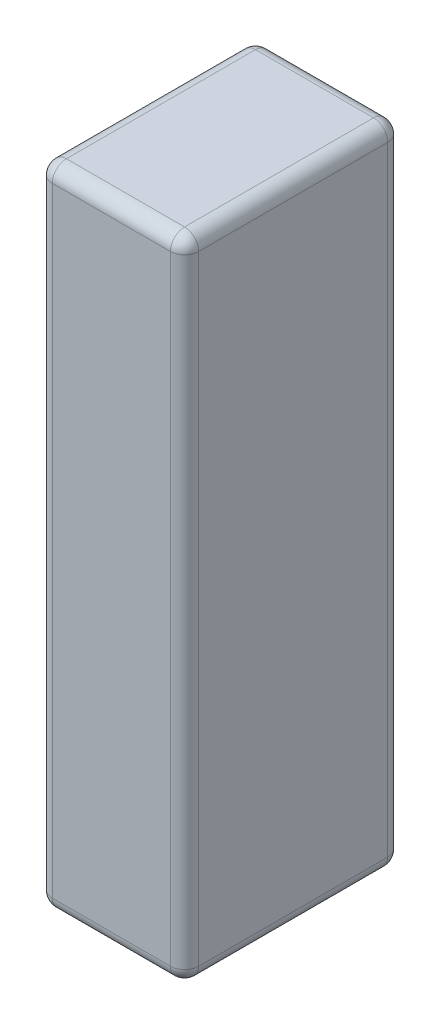
ISO-10303-21;
HEADER;
FILE_DESCRIPTION(('STEP AP214'),'2;1');
FILE_NAME('part.step','',(''),(''),'','','');
FILE_SCHEMA(('AUTOMOTIVE_DESIGN { 1 0 10303 214 1 1 1 1 }'));
ENDSEC;
DATA;
#1=APPLICATION_CONTEXT('core data for automotive mechanical design processes');
#2=APPLICATION_PROTOCOL_DEFINITION('international standard','automotive_design',2000,#1);
#3=PRODUCT_CONTEXT('',#1,'mechanical');
#4=PRODUCT('Part','Part','',(#3));
#5=PRODUCT_RELATED_PRODUCT_CATEGORY('part','',(#4));
#6=PRODUCT_DEFINITION_FORMATION('','',#4);
#7=PRODUCT_DEFINITION_CONTEXT('part definition',#1,'design');
#8=PRODUCT_DEFINITION('design','',#6,#7);
#9=PRODUCT_DEFINITION_SHAPE('','',#8);
#10=(LENGTH_UNIT() NAMED_UNIT(*) SI_UNIT(.MILLI.,.METRE.));
#11=(NAMED_UNIT(*) PLANE_ANGLE_UNIT() SI_UNIT($,.RADIAN.));
#12=(NAMED_UNIT(*) SI_UNIT($,.STERADIAN.) SOLID_ANGLE_UNIT());
#13=UNCERTAINTY_MEASURE_WITH_UNIT(LENGTH_MEASURE(1.E-05),#10,'distance_accuracy_value','');
#14=(GEOMETRIC_REPRESENTATION_CONTEXT(3) GLOBAL_UNCERTAINTY_ASSIGNED_CONTEXT((#13)) GLOBAL_UNIT_ASSIGNED_CONTEXT((#10,
#11,#12)) REPRESENTATION_CONTEXT('',''));
#15=CARTESIAN_POINT('',(0.,0.,0.));
#16=DIRECTION('',(0.,0.,1.));
#17=DIRECTION('',(1.,0.,0.));
#18=AXIS2_PLACEMENT_3D('',#15,#16,#17);
#19=CARTESIAN_POINT('',(0.,137.,0.));
#20=DIRECTION('',(1.,0.,0.));
#21=DIRECTION('',(0.,0.,-1.));
#22=AXIS2_PLACEMENT_3D('',#19,#20,#21);
#23=PLANE('',#22);
#24=DIRECTION('',(0.,0.,1.));
#25=VECTOR('',#24,1.);
#26=CARTESIAN_POINT('',(0.,134.,0.));
#27=LINE('',#26,#25);
#28=CARTESIAN_POINT('',(0.,134.,-3.));
#29=VERTEX_POINT('',#28);
#30=CARTESIAN_POINT('',(0.,134.,-43.));
#31=VERTEX_POINT('',#30);
#32=EDGE_CURVE('E153',#29,#31,#27,.F.);
#33=ORIENTED_EDGE('',*,*,#32,.T.);
#34=DIRECTION('',(0.,-1.,0.));
#35=VECTOR('',#34,1.);
#36=CARTESIAN_POINT('',(0.,137.,-43.));
#37=LINE('',#36,#35);
#38=CARTESIAN_POINT('',(0.,3.,-43.));
#39=VERTEX_POINT('',#38);
#40=EDGE_CURVE('E221',#31,#39,#37,.T.);
#41=ORIENTED_EDGE('',*,*,#40,.T.);
#42=DIRECTION('',(0.,0.,1.));
#43=VECTOR('',#42,1.);
#44=CARTESIAN_POINT('',(0.,3.,0.));
#45=LINE('',#44,#43);
#46=CARTESIAN_POINT('',(0.,3.,-3.));
#47=VERTEX_POINT('',#46);
#48=EDGE_CURVE('E280',#39,#47,#45,.T.);
#49=ORIENTED_EDGE('',*,*,#48,.T.);
#50=DIRECTION('',(0.,-1.,0.));
#51=VECTOR('',#50,1.);
#52=CARTESIAN_POINT('',(0.,137.,-3.));
#53=LINE('',#52,#51);
#54=EDGE_CURVE('E278',#47,#29,#53,.F.);
#55=ORIENTED_EDGE('',*,*,#54,.T.);
#56=EDGE_LOOP('',(#33,#41,#49,#55));
#57=FACE_BOUND('',#56,.T.);
#58=ADVANCED_FACE('F34',(#57),#23,.F.);
#59=CARTESIAN_POINT('',(0.,137.,0.));
#60=DIRECTION('',(0.,0.,-1.));
#61=DIRECTION('',(-1.,0.,0.));
#62=AXIS2_PLACEMENT_3D('',#59,#60,#61);
#63=PLANE('',#62);
#64=DIRECTION('',(1.,0.,0.));
#65=VECTOR('',#64,1.);
#66=CARTESIAN_POINT('',(0.,134.,0.));
#67=LINE('',#66,#65);
#68=CARTESIAN_POINT('',(28.,134.,0.));
#69=VERTEX_POINT('',#68);
#70=CARTESIAN_POINT('',(3.,134.,0.));
#71=VERTEX_POINT('',#70);
#72=EDGE_CURVE('E43',#69,#71,#67,.F.);
#73=ORIENTED_EDGE('',*,*,#72,.T.);
#74=DIRECTION('',(0.,-1.,0.));
#75=VECTOR('',#74,1.);
#76=CARTESIAN_POINT('',(3.,137.,0.));
#77=LINE('',#76,#75);
#78=CARTESIAN_POINT('',(3.,3.,0.));
#79=VERTEX_POINT('',#78);
#80=EDGE_CURVE('E11',#71,#79,#77,.T.);
#81=ORIENTED_EDGE('',*,*,#80,.T.);
#82=DIRECTION('',(1.,0.,0.));
#83=VECTOR('',#82,1.);
#84=CARTESIAN_POINT('',(31.,3.,0.));
#85=LINE('',#84,#83);
#86=CARTESIAN_POINT('',(28.,3.,0.));
#87=VERTEX_POINT('',#86);
#88=EDGE_CURVE('E227',#79,#87,#85,.T.);
#89=ORIENTED_EDGE('',*,*,#88,.T.);
#90=DIRECTION('',(0.,-1.,0.));
#91=VECTOR('',#90,1.);
#92=CARTESIAN_POINT('',(28.,137.,0.));
#93=LINE('',#92,#91);
#94=EDGE_CURVE('E54',#87,#69,#93,.F.);
#95=ORIENTED_EDGE('',*,*,#94,.T.);
#96=EDGE_LOOP('',(#73,#81,#89,#95));
#97=FACE_BOUND('',#96,.T.);
#98=ADVANCED_FACE('F318',(#97),#63,.F.);
#99=CARTESIAN_POINT('',(31.,137.,0.));
#100=DIRECTION('',(-1.,0.,0.));
#101=DIRECTION('',(0.,0.,1.));
#102=AXIS2_PLACEMENT_3D('',#99,#100,#101);
#103=PLANE('',#102);
#104=DIRECTION('',(0.,-1.,0.));
#105=VECTOR('',#104,1.);
#106=CARTESIAN_POINT('',(31.,137.,-43.));
#107=LINE('',#106,#105);
#108=CARTESIAN_POINT('',(31.,3.,-43.));
#109=VERTEX_POINT('',#108);
#110=CARTESIAN_POINT('',(31.,134.,-43.));
#111=VERTEX_POINT('',#110);
#112=EDGE_CURVE('E216',#109,#111,#107,.F.);
#113=ORIENTED_EDGE('',*,*,#112,.T.);
#114=DIRECTION('',(0.,0.,-1.));
#115=VECTOR('',#114,1.);
#116=CARTESIAN_POINT('',(31.,134.,0.));
#117=LINE('',#116,#115);
#118=CARTESIAN_POINT('',(31.,134.,-3.));
#119=VERTEX_POINT('',#118);
#120=EDGE_CURVE('E219',#111,#119,#117,.F.);
#121=ORIENTED_EDGE('',*,*,#120,.T.);
#122=DIRECTION('',(0.,-1.,0.));
#123=VECTOR('',#122,1.);
#124=CARTESIAN_POINT('',(31.,137.,-3.));
#125=LINE('',#124,#123);
#126=CARTESIAN_POINT('',(31.,3.,-3.));
#127=VERTEX_POINT('',#126);
#128=EDGE_CURVE('E217',#119,#127,#125,.T.);
#129=ORIENTED_EDGE('',*,*,#128,.T.);
#130=DIRECTION('',(0.,0.,-1.));
#131=VECTOR('',#130,1.);
#132=CARTESIAN_POINT('',(31.,3.,-46.));
#133=LINE('',#132,#131);
#134=EDGE_CURVE('E213',#127,#109,#133,.T.);
#135=ORIENTED_EDGE('',*,*,#134,.T.);
#136=EDGE_LOOP('',(#113,#121,#129,#135));
#137=FACE_BOUND('',#136,.T.);
#138=ADVANCED_FACE('F298',(#137),#103,.F.);
#139=CARTESIAN_POINT('',(0.,137.,-46.));
#140=DIRECTION('',(0.,0.,1.));
#141=DIRECTION('',(1.,0.,0.));
#142=AXIS2_PLACEMENT_3D('',#139,#140,#141);
#143=PLANE('',#142);
#144=DIRECTION('',(-1.,0.,0.));
#145=VECTOR('',#144,1.);
#146=CARTESIAN_POINT('',(0.,3.,-46.));
#147=LINE('',#146,#145);
#148=CARTESIAN_POINT('',(28.,3.,-46.));
#149=VERTEX_POINT('',#148);
#150=CARTESIAN_POINT('',(3.,3.,-46.));
#151=VERTEX_POINT('',#150);
#152=EDGE_CURVE('E257',#149,#151,#147,.T.);
#153=ORIENTED_EDGE('',*,*,#152,.T.);
#154=DIRECTION('',(0.,-1.,0.));
#155=VECTOR('',#154,1.);
#156=CARTESIAN_POINT('',(3.,137.,-46.));
#157=LINE('',#156,#155);
#158=CARTESIAN_POINT('',(3.,134.,-46.));
#159=VERTEX_POINT('',#158);
#160=EDGE_CURVE('E263',#151,#159,#157,.F.);
#161=ORIENTED_EDGE('',*,*,#160,.T.);
#162=DIRECTION('',(-1.,0.,0.));
#163=VECTOR('',#162,1.);
#164=CARTESIAN_POINT('',(0.,134.,-46.));
#165=LINE('',#164,#163);
#166=CARTESIAN_POINT('',(28.,134.,-46.));
#167=VERTEX_POINT('',#166);
#168=EDGE_CURVE('E260',#159,#167,#165,.F.);
#169=ORIENTED_EDGE('',*,*,#168,.T.);
#170=DIRECTION('',(0.,-1.,0.));
#171=VECTOR('',#170,1.);
#172=CARTESIAN_POINT('',(28.,137.,-46.));
#173=LINE('',#172,#171);
#174=EDGE_CURVE('E252',#167,#149,#173,.T.);
#175=ORIENTED_EDGE('',*,*,#174,.T.);
#176=EDGE_LOOP('',(#153,#161,#169,#175));
#177=FACE_BOUND('',#176,.T.);
#178=ADVANCED_FACE('F261',(#177),#143,.F.);
#179=CARTESIAN_POINT('',(0.,137.,0.));
#180=DIRECTION('',(0.,-1.,0.));
#181=DIRECTION('',(0.,0.,-1.));
#182=AXIS2_PLACEMENT_3D('',#179,#180,#181);
#183=PLANE('',#182);
#184=DIRECTION('',(0.,0.,-1.));
#185=VECTOR('',#184,1.);
#186=CARTESIAN_POINT('',(28.,137.,0.));
#187=LINE('',#186,#185);
#188=CARTESIAN_POINT('',(28.,137.,-3.));
#189=VERTEX_POINT('',#188);
#190=CARTESIAN_POINT('',(28.,137.,-43.));
#191=VERTEX_POINT('',#190);
#192=EDGE_CURVE('E132',#189,#191,#187,.T.);
#193=ORIENTED_EDGE('',*,*,#192,.T.);
#194=DIRECTION('',(-1.,0.,0.));
#195=VECTOR('',#194,1.);
#196=CARTESIAN_POINT('',(0.,137.,-43.));
#197=LINE('',#196,#195);
#198=CARTESIAN_POINT('',(3.,137.,-43.));
#199=VERTEX_POINT('',#198);
#200=EDGE_CURVE('E128',#191,#199,#197,.T.);
#201=ORIENTED_EDGE('',*,*,#200,.T.);
#202=DIRECTION('',(0.,0.,1.));
#203=VECTOR('',#202,1.);
#204=CARTESIAN_POINT('',(3.,137.,0.));
#205=LINE('',#204,#203);
#206=CARTESIAN_POINT('',(3.,137.,-3.));
#207=VERTEX_POINT('',#206);
#208=EDGE_CURVE('E122',#199,#207,#205,.T.);
#209=ORIENTED_EDGE('',*,*,#208,.T.);
#210=DIRECTION('',(1.,0.,0.));
#211=VECTOR('',#210,1.);
#212=CARTESIAN_POINT('',(0.,137.,-3.));
#213=LINE('',#212,#211);
#214=EDGE_CURVE('E125',#207,#189,#213,.T.);
#215=ORIENTED_EDGE('',*,*,#214,.T.);
#216=EDGE_LOOP('',(#193,#201,#209,#215));
#217=FACE_BOUND('',#216,.T.);
#218=ADVANCED_FACE('F124',(#217),#183,.F.);
#219=CARTESIAN_POINT('',(0.,0.,0.));
#220=DIRECTION('',(0.,-1.,0.));
#221=DIRECTION('',(0.,0.,-1.));
#222=AXIS2_PLACEMENT_3D('',#219,#220,#221);
#223=PLANE('',#222);
#224=DIRECTION('',(0.,0.,1.));
#225=VECTOR('',#224,1.);
#226=CARTESIAN_POINT('',(3.,0.,-46.));
#227=LINE('',#226,#225);
#228=CARTESIAN_POINT('',(3.,0.,-3.));
#229=VERTEX_POINT('',#228);
#230=CARTESIAN_POINT('',(3.,0.,-43.));
#231=VERTEX_POINT('',#230);
#232=EDGE_CURVE('E274',#229,#231,#227,.F.);
#233=ORIENTED_EDGE('',*,*,#232,.T.);
#234=DIRECTION('',(-1.,0.,0.));
#235=VECTOR('',#234,1.);
#236=CARTESIAN_POINT('',(31.,0.,-43.));
#237=LINE('',#236,#235);
#238=CARTESIAN_POINT('',(28.,0.,-43.));
#239=VERTEX_POINT('',#238);
#240=EDGE_CURVE('E276',#231,#239,#237,.F.);
#241=ORIENTED_EDGE('',*,*,#240,.T.);
#242=DIRECTION('',(0.,0.,-1.));
#243=VECTOR('',#242,1.);
#244=CARTESIAN_POINT('',(28.,0.,0.));
#245=LINE('',#244,#243);
#246=CARTESIAN_POINT('',(28.,0.,-3.));
#247=VERTEX_POINT('',#246);
#248=EDGE_CURVE('E211',#239,#247,#245,.F.);
#249=ORIENTED_EDGE('',*,*,#248,.T.);
#250=DIRECTION('',(1.,0.,0.));
#251=VECTOR('',#250,1.);
#252=CARTESIAN_POINT('',(0.,0.,-3.));
#253=LINE('',#252,#251);
#254=EDGE_CURVE('E268',#247,#229,#253,.F.);
#255=ORIENTED_EDGE('',*,*,#254,.T.);
#256=EDGE_LOOP('',(#233,#241,#249,#255));
#257=FACE_BOUND('',#256,.T.);
#258=ADVANCED_FACE('F357',(#257),#223,.T.);
#259=CARTESIAN_POINT('',(0.,3.,-3.));
#260=DIRECTION('',(-1.,0.,0.));
#261=DIRECTION('',(0.,0.,1.));
#262=AXIS2_PLACEMENT_3D('',#259,#260,#261);
#263=CYLINDRICAL_SURFACE('',#262,3.);
#264=CARTESIAN_POINT('',(28.,3.,-3.));
#265=DIRECTION('',(1.,0.,0.));
#266=DIRECTION('',(0.,0.,-1.));
#267=AXIS2_PLACEMENT_3D('',#264,#265,#266);
#268=CIRCLE('',#267,3.);
#269=EDGE_CURVE('E38',#87,#247,#268,.T.);
#270=ORIENTED_EDGE('',*,*,#269,.F.);
#271=ORIENTED_EDGE('',*,*,#88,.F.);
#272=CARTESIAN_POINT('',(3.,3.,-3.));
#273=DIRECTION('',(-1.,0.,0.));
#274=DIRECTION('',(0.,0.,1.));
#275=AXIS2_PLACEMENT_3D('',#272,#273,#274);
#276=CIRCLE('',#275,3.);
#277=EDGE_CURVE('E191',#229,#79,#276,.T.);
#278=ORIENTED_EDGE('',*,*,#277,.F.);
#279=ORIENTED_EDGE('',*,*,#254,.F.);
#280=EDGE_LOOP('',(#270,#271,#278,#279));
#281=FACE_BOUND('',#280,.T.);
#282=ADVANCED_FACE('F36',(#281),#263,.T.);
#283=CARTESIAN_POINT('',(28.,3.,-3.));
#284=DIRECTION('',(0.,0.,1.));
#285=DIRECTION('',(1.,0.,0.));
#286=AXIS2_PLACEMENT_3D('',#283,#284,#285);
#287=SPHERICAL_SURFACE('',#286,3.);
#288=CARTESIAN_POINT('',(28.,3.,-3.));
#289=DIRECTION('',(0.,-1.,0.));
#290=DIRECTION('',(0.,0.,-1.));
#291=AXIS2_PLACEMENT_3D('',#288,#289,#290);
#292=CIRCLE('',#291,3.);
#293=EDGE_CURVE('E186',#87,#127,#292,.F.);
#294=ORIENTED_EDGE('',*,*,#293,.F.);
#295=ORIENTED_EDGE('',*,*,#269,.T.);
#296=CARTESIAN_POINT('',(28.,3.,-3.));
#297=DIRECTION('',(0.,0.,1.));
#298=DIRECTION('',(1.,0.,0.));
#299=AXIS2_PLACEMENT_3D('',#296,#297,#298);
#300=CIRCLE('',#299,3.);
#301=EDGE_CURVE('E189',#127,#247,#300,.F.);
#302=ORIENTED_EDGE('',*,*,#301,.F.);
#303=EDGE_LOOP('',(#294,#295,#302));
#304=FACE_BOUND('',#303,.T.);
#305=ADVANCED_FACE('F203',(#304),#287,.T.);
#306=CARTESIAN_POINT('',(3.,3.,-3.));
#307=DIRECTION('',(0.,0.,1.));
#308=DIRECTION('',(1.,0.,0.));
#309=AXIS2_PLACEMENT_3D('',#306,#307,#308);
#310=SPHERICAL_SURFACE('',#309,3.);
#311=CARTESIAN_POINT('',(3.,3.,-3.));
#312=DIRECTION('',(0.,0.,1.));
#313=DIRECTION('',(1.,0.,0.));
#314=AXIS2_PLACEMENT_3D('',#311,#312,#313);
#315=CIRCLE('',#314,3.);
#316=EDGE_CURVE('E181',#229,#47,#315,.F.);
#317=ORIENTED_EDGE('',*,*,#316,.F.);
#318=ORIENTED_EDGE('',*,*,#277,.T.);
#319=CARTESIAN_POINT('',(3.,3.,-3.));
#320=DIRECTION('',(0.,-1.,0.));
#321=DIRECTION('',(0.,0.,-1.));
#322=AXIS2_PLACEMENT_3D('',#319,#320,#321);
#323=CIRCLE('',#322,3.);
#324=EDGE_CURVE('E184',#47,#79,#323,.F.);
#325=ORIENTED_EDGE('',*,*,#324,.F.);
#326=EDGE_LOOP('',(#317,#318,#325));
#327=FACE_BOUND('',#326,.T.);
#328=ADVANCED_FACE('F354',(#327),#310,.T.);
#329=CARTESIAN_POINT('',(28.,3.,0.));
#330=DIRECTION('',(0.,0.,1.));
#331=DIRECTION('',(1.,0.,0.));
#332=AXIS2_PLACEMENT_3D('',#329,#330,#331);
#333=CYLINDRICAL_SURFACE('',#332,3.);
#334=ORIENTED_EDGE('',*,*,#301,.T.);
#335=ORIENTED_EDGE('',*,*,#248,.F.);
#336=CARTESIAN_POINT('',(28.,3.,-43.));
#337=DIRECTION('',(0.,0.,-1.));
#338=DIRECTION('',(-1.,0.,0.));
#339=AXIS2_PLACEMENT_3D('',#336,#337,#338);
#340=CIRCLE('',#339,3.);
#341=EDGE_CURVE('E176',#109,#239,#340,.T.);
#342=ORIENTED_EDGE('',*,*,#341,.F.);
#343=ORIENTED_EDGE('',*,*,#134,.F.);
#344=EDGE_LOOP('',(#334,#335,#342,#343));
#345=FACE_BOUND('',#344,.T.);
#346=ADVANCED_FACE('F209',(#345),#333,.T.);
#347=CARTESIAN_POINT('',(28.,137.,-3.));
#348=DIRECTION('',(0.,-1.,0.));
#349=DIRECTION('',(0.,0.,-1.));
#350=AXIS2_PLACEMENT_3D('',#347,#348,#349);
#351=CYLINDRICAL_SURFACE('',#350,3.);
#352=ORIENTED_EDGE('',*,*,#293,.T.);
#353=ORIENTED_EDGE('',*,*,#128,.F.);
#354=CARTESIAN_POINT('',(28.,134.,-3.));
#355=DIRECTION('',(0.,1.,0.));
#356=DIRECTION('',(0.,0.,1.));
#357=AXIS2_PLACEMENT_3D('',#354,#355,#356);
#358=CIRCLE('',#357,3.);
#359=EDGE_CURVE('E173',#69,#119,#358,.T.);
#360=ORIENTED_EDGE('',*,*,#359,.F.);
#361=ORIENTED_EDGE('',*,*,#94,.F.);
#362=EDGE_LOOP('',(#352,#353,#360,#361));
#363=FACE_BOUND('',#362,.T.);
#364=ADVANCED_FACE('F302',(#363),#351,.T.);
#365=CARTESIAN_POINT('',(0.,134.,-3.));
#366=DIRECTION('',(1.,0.,0.));
#367=DIRECTION('',(0.,0.,-1.));
#368=AXIS2_PLACEMENT_3D('',#365,#366,#367);
#369=CYLINDRICAL_SURFACE('',#368,3.);
#370=CARTESIAN_POINT('',(3.,134.,-3.));
#371=DIRECTION('',(-1.,0.,0.));
#372=DIRECTION('',(0.,0.,1.));
#373=AXIS2_PLACEMENT_3D('',#370,#371,#372);
#374=CIRCLE('',#373,3.);
#375=EDGE_CURVE('E138',#71,#207,#374,.T.);
#376=ORIENTED_EDGE('',*,*,#375,.F.);
#377=ORIENTED_EDGE('',*,*,#72,.F.);
#378=CARTESIAN_POINT('',(28.,134.,-3.));
#379=DIRECTION('',(1.,0.,0.));
#380=DIRECTION('',(0.,0.,-1.));
#381=AXIS2_PLACEMENT_3D('',#378,#379,#380);
#382=CIRCLE('',#381,3.);
#383=EDGE_CURVE('E141',#189,#69,#382,.T.);
#384=ORIENTED_EDGE('',*,*,#383,.F.);
#385=ORIENTED_EDGE('',*,*,#214,.F.);
#386=EDGE_LOOP('',(#376,#377,#384,#385));
#387=FACE_BOUND('',#386,.T.);
#388=ADVANCED_FACE('F137',(#387),#369,.T.);
#389=CARTESIAN_POINT('',(3.,137.,-3.));
#390=DIRECTION('',(0.,-1.,0.));
#391=DIRECTION('',(0.,0.,-1.));
#392=AXIS2_PLACEMENT_3D('',#389,#390,#391);
#393=CYLINDRICAL_SURFACE('',#392,3.);
#394=ORIENTED_EDGE('',*,*,#324,.T.);
#395=ORIENTED_EDGE('',*,*,#80,.F.);
#396=CARTESIAN_POINT('',(3.,134.,-3.));
#397=DIRECTION('',(0.,1.,0.));
#398=DIRECTION('',(0.,0.,1.));
#399=AXIS2_PLACEMENT_3D('',#396,#397,#398);
#400=CIRCLE('',#399,3.);
#401=EDGE_CURVE('E150',#29,#71,#400,.T.);
#402=ORIENTED_EDGE('',*,*,#401,.F.);
#403=ORIENTED_EDGE('',*,*,#54,.F.);
#404=EDGE_LOOP('',(#394,#395,#402,#403));
#405=FACE_BOUND('',#404,.T.);
#406=ADVANCED_FACE('F356',(#405),#393,.T.);
#407=CARTESIAN_POINT('',(3.,3.,0.));
#408=DIRECTION('',(0.,0.,-1.));
#409=DIRECTION('',(-1.,0.,0.));
#410=AXIS2_PLACEMENT_3D('',#407,#408,#409);
#411=CYLINDRICAL_SURFACE('',#410,3.);
#412=ORIENTED_EDGE('',*,*,#316,.T.);
#413=ORIENTED_EDGE('',*,*,#48,.F.);
#414=CARTESIAN_POINT('',(3.,3.,-43.));
#415=DIRECTION('',(0.,0.,-1.));
#416=DIRECTION('',(-1.,0.,0.));
#417=AXIS2_PLACEMENT_3D('',#414,#415,#416);
#418=CIRCLE('',#417,3.);
#419=EDGE_CURVE('E168',#231,#39,#418,.T.);
#420=ORIENTED_EDGE('',*,*,#419,.F.);
#421=ORIENTED_EDGE('',*,*,#232,.F.);
#422=EDGE_LOOP('',(#412,#413,#420,#421));
#423=FACE_BOUND('',#422,.T.);
#424=ADVANCED_FACE('F352',(#423),#411,.T.);
#425=CARTESIAN_POINT('',(0.,3.,-43.));
#426=DIRECTION('',(1.,0.,0.));
#427=DIRECTION('',(0.,0.,-1.));
#428=AXIS2_PLACEMENT_3D('',#425,#426,#427);
#429=CYLINDRICAL_SURFACE('',#428,3.);
#430=CARTESIAN_POINT('',(28.,3.,-43.));
#431=DIRECTION('',(1.,0.,0.));
#432=DIRECTION('',(0.,0.,-1.));
#433=AXIS2_PLACEMENT_3D('',#430,#431,#432);
#434=CIRCLE('',#433,3.);
#435=EDGE_CURVE('E178',#239,#149,#434,.T.);
#436=ORIENTED_EDGE('',*,*,#435,.F.);
#437=ORIENTED_EDGE('',*,*,#240,.F.);
#438=CARTESIAN_POINT('',(3.,3.,-43.));
#439=DIRECTION('',(-1.,0.,0.));
#440=DIRECTION('',(0.,0.,1.));
#441=AXIS2_PLACEMENT_3D('',#438,#439,#440);
#442=CIRCLE('',#441,3.);
#443=EDGE_CURVE('E165',#151,#231,#442,.T.);
#444=ORIENTED_EDGE('',*,*,#443,.F.);
#445=ORIENTED_EDGE('',*,*,#152,.F.);
#446=EDGE_LOOP('',(#436,#437,#444,#445));
#447=FACE_BOUND('',#446,.T.);
#448=ADVANCED_FACE('F314',(#447),#429,.T.);
#449=CARTESIAN_POINT('',(28.,3.,-43.));
#450=DIRECTION('',(0.,0.,1.));
#451=DIRECTION('',(1.,0.,0.));
#452=AXIS2_PLACEMENT_3D('',#449,#450,#451);
#453=SPHERICAL_SURFACE('',#452,3.);
#454=ORIENTED_EDGE('',*,*,#341,.T.);
#455=ORIENTED_EDGE('',*,*,#435,.T.);
#456=CARTESIAN_POINT('',(28.,3.,-43.));
#457=DIRECTION('',(0.,-1.,0.));
#458=DIRECTION('',(0.,0.,-1.));
#459=AXIS2_PLACEMENT_3D('',#456,#457,#458);
#460=CIRCLE('',#459,3.);
#461=EDGE_CURVE('E157',#109,#149,#460,.F.);
#462=ORIENTED_EDGE('',*,*,#461,.F.);
#463=EDGE_LOOP('',(#454,#455,#462));
#464=FACE_BOUND('',#463,.T.);
#465=ADVANCED_FACE('F306',(#464),#453,.T.);
#466=CARTESIAN_POINT('',(28.,134.,-3.));
#467=DIRECTION('',(0.,0.,1.));
#468=DIRECTION('',(1.,0.,0.));
#469=AXIS2_PLACEMENT_3D('',#466,#467,#468);
#470=SPHERICAL_SURFACE('',#469,3.);
#471=ORIENTED_EDGE('',*,*,#383,.T.);
#472=ORIENTED_EDGE('',*,*,#359,.T.);
#473=CARTESIAN_POINT('',(28.,134.,-3.));
#474=DIRECTION('',(0.,0.,1.));
#475=DIRECTION('',(1.,0.,0.));
#476=AXIS2_PLACEMENT_3D('',#473,#474,#475);
#477=CIRCLE('',#476,3.);
#478=EDGE_CURVE('E154',#189,#119,#477,.F.);
#479=ORIENTED_EDGE('',*,*,#478,.F.);
#480=EDGE_LOOP('',(#471,#472,#479));
#481=FACE_BOUND('',#480,.T.);
#482=ADVANCED_FACE('F304',(#481),#470,.T.);
#483=CARTESIAN_POINT('',(3.,134.,-3.));
#484=DIRECTION('',(0.,0.,1.));
#485=DIRECTION('',(1.,0.,0.));
#486=AXIS2_PLACEMENT_3D('',#483,#484,#485);
#487=SPHERICAL_SURFACE('',#486,3.);
#488=ORIENTED_EDGE('',*,*,#401,.T.);
#489=ORIENTED_EDGE('',*,*,#375,.T.);
#490=CARTESIAN_POINT('',(3.,134.,-3.));
#491=DIRECTION('',(0.,0.,1.));
#492=DIRECTION('',(1.,0.,0.));
#493=AXIS2_PLACEMENT_3D('',#490,#491,#492);
#494=CIRCLE('',#493,3.);
#495=EDGE_CURVE('E147',#29,#207,#494,.F.);
#496=ORIENTED_EDGE('',*,*,#495,.F.);
#497=EDGE_LOOP('',(#488,#489,#496));
#498=FACE_BOUND('',#497,.T.);
#499=ADVANCED_FACE('F146',(#498),#487,.T.);
#500=CARTESIAN_POINT('',(3.,3.,-43.));
#501=DIRECTION('',(0.,0.,1.));
#502=DIRECTION('',(1.,0.,0.));
#503=AXIS2_PLACEMENT_3D('',#500,#501,#502);
#504=SPHERICAL_SURFACE('',#503,3.);
#505=ORIENTED_EDGE('',*,*,#443,.T.);
#506=ORIENTED_EDGE('',*,*,#419,.T.);
#507=CARTESIAN_POINT('',(3.,3.,-43.));
#508=DIRECTION('',(0.,-1.,0.));
#509=DIRECTION('',(0.,0.,-1.));
#510=AXIS2_PLACEMENT_3D('',#507,#508,#509);
#511=CIRCLE('',#510,3.);
#512=EDGE_CURVE('E155',#151,#39,#511,.F.);
#513=ORIENTED_EDGE('',*,*,#512,.F.);
#514=EDGE_LOOP('',(#505,#506,#513));
#515=FACE_BOUND('',#514,.T.);
#516=ADVANCED_FACE('F312',(#515),#504,.T.);
#517=CARTESIAN_POINT('',(28.,137.,-43.));
#518=DIRECTION('',(0.,-1.,0.));
#519=DIRECTION('',(0.,0.,-1.));
#520=AXIS2_PLACEMENT_3D('',#517,#518,#519);
#521=CYLINDRICAL_SURFACE('',#520,3.);
#522=ORIENTED_EDGE('',*,*,#461,.T.);
#523=ORIENTED_EDGE('',*,*,#174,.F.);
#524=CARTESIAN_POINT('',(28.,134.,-43.));
#525=DIRECTION('',(0.,1.,0.));
#526=DIRECTION('',(0.,0.,1.));
#527=AXIS2_PLACEMENT_3D('',#524,#525,#526);
#528=CIRCLE('',#527,3.);
#529=EDGE_CURVE('E159',#111,#167,#528,.T.);
#530=ORIENTED_EDGE('',*,*,#529,.F.);
#531=ORIENTED_EDGE('',*,*,#112,.F.);
#532=EDGE_LOOP('',(#522,#523,#530,#531));
#533=FACE_BOUND('',#532,.T.);
#534=ADVANCED_FACE('F254',(#533),#521,.T.);
#535=CARTESIAN_POINT('',(28.,134.,0.));
#536=DIRECTION('',(0.,0.,-1.));
#537=DIRECTION('',(-1.,0.,0.));
#538=AXIS2_PLACEMENT_3D('',#535,#536,#537);
#539=CYLINDRICAL_SURFACE('',#538,3.);
#540=ORIENTED_EDGE('',*,*,#478,.T.);
#541=ORIENTED_EDGE('',*,*,#120,.F.);
#542=CARTESIAN_POINT('',(28.,134.,-43.));
#543=DIRECTION('',(0.,0.,-1.));
#544=DIRECTION('',(-1.,0.,0.));
#545=AXIS2_PLACEMENT_3D('',#542,#543,#544);
#546=CIRCLE('',#545,3.);
#547=EDGE_CURVE('E241',#191,#111,#546,.T.);
#548=ORIENTED_EDGE('',*,*,#547,.F.);
#549=ORIENTED_EDGE('',*,*,#192,.F.);
#550=EDGE_LOOP('',(#540,#541,#548,#549));
#551=FACE_BOUND('',#550,.T.);
#552=ADVANCED_FACE('F297',(#551),#539,.T.);
#553=CARTESIAN_POINT('',(3.,134.,0.));
#554=DIRECTION('',(0.,0.,1.));
#555=DIRECTION('',(1.,0.,0.));
#556=AXIS2_PLACEMENT_3D('',#553,#554,#555);
#557=CYLINDRICAL_SURFACE('',#556,3.);
#558=ORIENTED_EDGE('',*,*,#495,.T.);
#559=ORIENTED_EDGE('',*,*,#208,.F.);
#560=CARTESIAN_POINT('',(3.,134.,-43.));
#561=DIRECTION('',(0.,0.,-1.));
#562=DIRECTION('',(-1.,0.,0.));
#563=AXIS2_PLACEMENT_3D('',#560,#561,#562);
#564=CIRCLE('',#563,3.);
#565=EDGE_CURVE('E238',#31,#199,#564,.T.);
#566=ORIENTED_EDGE('',*,*,#565,.F.);
#567=ORIENTED_EDGE('',*,*,#32,.F.);
#568=EDGE_LOOP('',(#558,#559,#566,#567));
#569=FACE_BOUND('',#568,.T.);
#570=ADVANCED_FACE('F152',(#569),#557,.T.);
#571=CARTESIAN_POINT('',(3.,137.,-43.));
#572=DIRECTION('',(0.,-1.,0.));
#573=DIRECTION('',(0.,0.,-1.));
#574=AXIS2_PLACEMENT_3D('',#571,#572,#573);
#575=CYLINDRICAL_SURFACE('',#574,3.);
#576=ORIENTED_EDGE('',*,*,#512,.T.);
#577=ORIENTED_EDGE('',*,*,#40,.F.);
#578=CARTESIAN_POINT('',(3.,134.,-43.));
#579=DIRECTION('',(0.,1.,0.));
#580=DIRECTION('',(0.,0.,1.));
#581=AXIS2_PLACEMENT_3D('',#578,#579,#580);
#582=CIRCLE('',#581,3.);
#583=EDGE_CURVE('E235',#159,#31,#582,.T.);
#584=ORIENTED_EDGE('',*,*,#583,.F.);
#585=ORIENTED_EDGE('',*,*,#160,.F.);
#586=EDGE_LOOP('',(#576,#577,#584,#585));
#587=FACE_BOUND('',#586,.T.);
#588=ADVANCED_FACE('F287',(#587),#575,.T.);
#589=CARTESIAN_POINT('',(28.,134.,-43.));
#590=DIRECTION('',(0.,0.,1.));
#591=DIRECTION('',(1.,0.,0.));
#592=AXIS2_PLACEMENT_3D('',#589,#590,#591);
#593=SPHERICAL_SURFACE('',#592,3.);
#594=ORIENTED_EDGE('',*,*,#547,.T.);
#595=ORIENTED_EDGE('',*,*,#529,.T.);
#596=CARTESIAN_POINT('',(28.,134.,-43.));
#597=DIRECTION('',(1.,0.,0.));
#598=DIRECTION('',(0.,0.,-1.));
#599=AXIS2_PLACEMENT_3D('',#596,#597,#598);
#600=CIRCLE('',#599,3.);
#601=EDGE_CURVE('E233',#191,#167,#600,.F.);
#602=ORIENTED_EDGE('',*,*,#601,.F.);
#603=EDGE_LOOP('',(#594,#595,#602));
#604=FACE_BOUND('',#603,.T.);
#605=ADVANCED_FACE('F248',(#604),#593,.T.);
#606=CARTESIAN_POINT('',(3.,134.,-43.));
#607=DIRECTION('',(0.,0.,1.));
#608=DIRECTION('',(1.,0.,0.));
#609=AXIS2_PLACEMENT_3D('',#606,#607,#608);
#610=SPHERICAL_SURFACE('',#609,3.);
#611=ORIENTED_EDGE('',*,*,#583,.T.);
#612=ORIENTED_EDGE('',*,*,#565,.T.);
#613=CARTESIAN_POINT('',(3.,134.,-43.));
#614=DIRECTION('',(-1.,0.,0.));
#615=DIRECTION('',(0.,0.,1.));
#616=AXIS2_PLACEMENT_3D('',#613,#614,#615);
#617=CIRCLE('',#616,3.);
#618=EDGE_CURVE('E231',#159,#199,#617,.F.);
#619=ORIENTED_EDGE('',*,*,#618,.F.);
#620=EDGE_LOOP('',(#611,#612,#619));
#621=FACE_BOUND('',#620,.T.);
#622=ADVANCED_FACE('F290',(#621),#610,.T.);
#623=CARTESIAN_POINT('',(0.,134.,-43.));
#624=DIRECTION('',(-1.,0.,0.));
#625=DIRECTION('',(0.,0.,1.));
#626=AXIS2_PLACEMENT_3D('',#623,#624,#625);
#627=CYLINDRICAL_SURFACE('',#626,3.);
#628=ORIENTED_EDGE('',*,*,#601,.T.);
#629=ORIENTED_EDGE('',*,*,#168,.F.);
#630=ORIENTED_EDGE('',*,*,#618,.T.);
#631=ORIENTED_EDGE('',*,*,#200,.F.);
#632=EDGE_LOOP('',(#628,#629,#630,#631));
#633=FACE_BOUND('',#632,.T.);
#634=ADVANCED_FACE('F291',(#633),#627,.T.);
#635=CLOSED_SHELL('',(#58,#98,#138,#178,#218,#258,#282,#305,#328,#346,#364,#388,#406,#424,#448,
#465,#482,#499,#516,#534,#552,#570,#588,#605,#622,#634));
#636=MANIFOLD_SOLID_BREP('B2',#635);
#637=ADVANCED_BREP_SHAPE_REPRESENTATION('',(#18,#636),#14);
#638=SHAPE_DEFINITION_REPRESENTATION(#9,#637);
ENDSEC;
END-ISO-10303-21;
